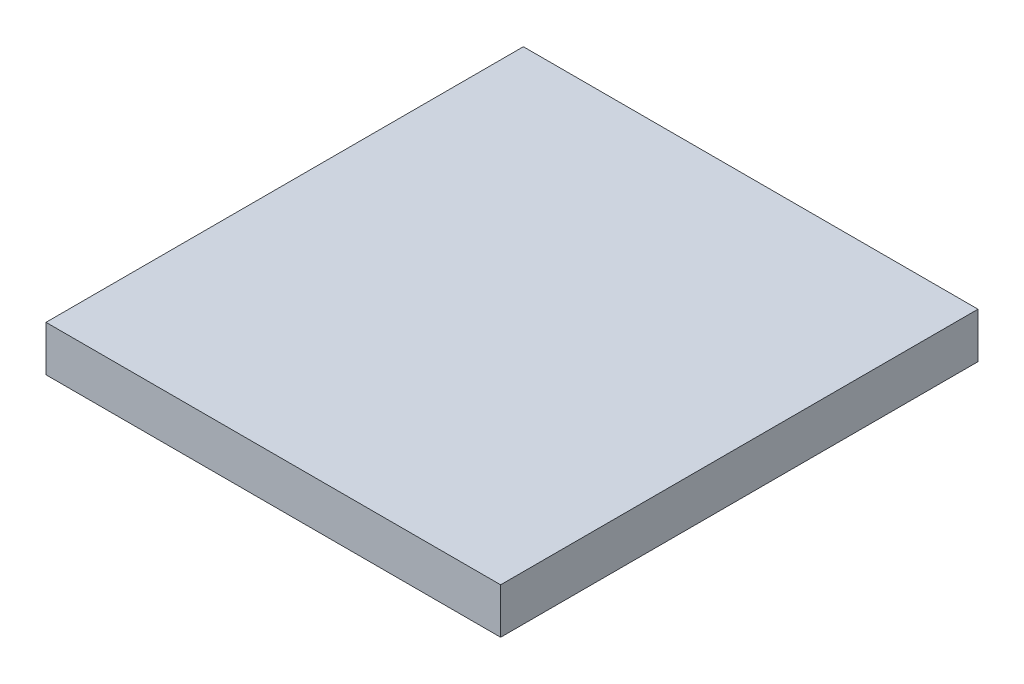
ISO-10303-21;
HEADER;
FILE_DESCRIPTION(('STEP AP214'),'2;1');
FILE_NAME('part.step','',(''),(''),'','','');
FILE_SCHEMA(('AUTOMOTIVE_DESIGN { 1 0 10303 214 1 1 1 1 }'));
ENDSEC;
DATA;
#1=APPLICATION_CONTEXT('core data for automotive mechanical design processes');
#2=APPLICATION_PROTOCOL_DEFINITION('international standard','automotive_design',2000,#1);
#3=PRODUCT_CONTEXT('',#1,'mechanical');
#4=PRODUCT('Part','Part','',(#3));
#5=PRODUCT_RELATED_PRODUCT_CATEGORY('part','',(#4));
#6=PRODUCT_DEFINITION_FORMATION('','',#4);
#7=PRODUCT_DEFINITION_CONTEXT('part definition',#1,'design');
#8=PRODUCT_DEFINITION('design','',#6,#7);
#9=PRODUCT_DEFINITION_SHAPE('','',#8);
#10=(LENGTH_UNIT() NAMED_UNIT(*) SI_UNIT(.MILLI.,.METRE.));
#11=(NAMED_UNIT(*) PLANE_ANGLE_UNIT() SI_UNIT($,.RADIAN.));
#12=(NAMED_UNIT(*) SI_UNIT($,.STERADIAN.) SOLID_ANGLE_UNIT());
#13=UNCERTAINTY_MEASURE_WITH_UNIT(LENGTH_MEASURE(1.E-05),#10,'distance_accuracy_value','');
#14=(GEOMETRIC_REPRESENTATION_CONTEXT(3) GLOBAL_UNCERTAINTY_ASSIGNED_CONTEXT((#13)) GLOBAL_UNIT_ASSIGNED_CONTEXT((#10,
#11,#12)) REPRESENTATION_CONTEXT('',''));
#15=CARTESIAN_POINT('',(0.,0.,0.));
#16=DIRECTION('',(0.,0.,1.));
#17=DIRECTION('',(1.,0.,0.));
#18=AXIS2_PLACEMENT_3D('',#15,#16,#17);
#19=CARTESIAN_POINT('',(6.0000007,0.60000134,0.));
#20=DIRECTION('',(0.,-1.,0.));
#21=DIRECTION('',(0.,0.,-1.));
#22=AXIS2_PLACEMENT_3D('',#19,#20,#21);
#23=PLANE('',#22);
#24=DIRECTION('',(0.,0.,-1.));
#25=VECTOR('',#24,1.);
#26=CARTESIAN_POINT('',(-6.0000007,0.60000134,0.));
#27=LINE('',#26,#25);
#28=CARTESIAN_POINT('',(-6.0000007,0.60000134,0.));
#29=VERTEX_POINT('',#28);
#30=CARTESIAN_POINT('',(-6.0000007,0.60000134,12.6000002));
#31=VERTEX_POINT('',#30);
#32=EDGE_CURVE('E20',#29,#31,#27,.F.);
#33=ORIENTED_EDGE('',*,*,#32,.T.);
#34=DIRECTION('',(-1.,0.,0.));
#35=VECTOR('',#34,1.);
#36=CARTESIAN_POINT('',(-6.0000007,0.60000134,12.6000002));
#37=LINE('',#36,#35);
#38=CARTESIAN_POINT('',(6.0000007,0.60000134,12.6000002));
#39=VERTEX_POINT('',#38);
#40=EDGE_CURVE('E55',#31,#39,#37,.F.);
#41=ORIENTED_EDGE('',*,*,#40,.T.);
#42=DIRECTION('',(0.,0.,1.));
#43=VECTOR('',#42,1.);
#44=CARTESIAN_POINT('',(6.0000007,0.60000134,0.));
#45=LINE('',#44,#43);
#46=CARTESIAN_POINT('',(6.0000007,0.60000134,0.));
#47=VERTEX_POINT('',#46);
#48=EDGE_CURVE('E74',#39,#47,#45,.F.);
#49=ORIENTED_EDGE('',*,*,#48,.T.);
#50=DIRECTION('',(-1.,0.,0.));
#51=VECTOR('',#50,1.);
#52=CARTESIAN_POINT('',(-6.0000007,0.60000134,0.));
#53=LINE('',#52,#51);
#54=EDGE_CURVE('E66',#29,#47,#53,.F.);
#55=ORIENTED_EDGE('',*,*,#54,.F.);
#56=EDGE_LOOP('',(#33,#41,#49,#55));
#57=FACE_BOUND('',#56,.T.);
#58=ADVANCED_FACE('F17',(#57),#23,.F.);
#59=CARTESIAN_POINT('',(-6.0000007,0.60000134,0.));
#60=DIRECTION('',(1.,0.,0.));
#61=DIRECTION('',(0.,0.,-1.));
#62=AXIS2_PLACEMENT_3D('',#59,#60,#61);
#63=PLANE('',#62);
#64=DIRECTION('',(0.,0.,1.));
#65=VECTOR('',#64,1.);
#66=CARTESIAN_POINT('',(-6.0000007,-0.5999988,0.));
#67=LINE('',#66,#65);
#68=CARTESIAN_POINT('',(-6.0000007,-0.5999988,0.));
#69=VERTEX_POINT('',#68);
#70=CARTESIAN_POINT('',(-6.0000007,-0.5999988,12.6000002));
#71=VERTEX_POINT('',#70);
#72=EDGE_CURVE('E72',#69,#71,#67,.T.);
#73=ORIENTED_EDGE('',*,*,#72,.T.);
#74=DIRECTION('',(0.,1.,0.));
#75=VECTOR('',#74,1.);
#76=CARTESIAN_POINT('',(-6.0000007,0.60000134,12.6000002));
#77=LINE('',#76,#75);
#78=EDGE_CURVE('E62',#71,#31,#77,.T.);
#79=ORIENTED_EDGE('',*,*,#78,.T.);
#80=ORIENTED_EDGE('',*,*,#32,.F.);
#81=DIRECTION('',(0.,1.,0.));
#82=VECTOR('',#81,1.);
#83=CARTESIAN_POINT('',(-6.0000007,0.60000134,0.));
#84=LINE('',#83,#82);
#85=EDGE_CURVE('E80',#69,#29,#84,.T.);
#86=ORIENTED_EDGE('',*,*,#85,.F.);
#87=EDGE_LOOP('',(#73,#79,#80,#86));
#88=FACE_BOUND('',#87,.T.);
#89=ADVANCED_FACE('F71',(#88),#63,.F.);
#90=CARTESIAN_POINT('',(-6.0000007,0.60000134,12.6000002));
#91=DIRECTION('',(0.,0.,-1.));
#92=DIRECTION('',(-1.,0.,0.));
#93=AXIS2_PLACEMENT_3D('',#90,#91,#92);
#94=PLANE('',#93);
#95=DIRECTION('',(1.,0.,0.));
#96=VECTOR('',#95,1.);
#97=CARTESIAN_POINT('',(-6.0000007,-0.5999988,12.6000002));
#98=LINE('',#97,#96);
#99=CARTESIAN_POINT('',(6.0000007,-0.5999988,12.6000002));
#100=VERTEX_POINT('',#99);
#101=EDGE_CURVE('E83',#71,#100,#98,.T.);
#102=ORIENTED_EDGE('',*,*,#101,.T.);
#103=DIRECTION('',(0.,1.,0.));
#104=VECTOR('',#103,1.);
#105=CARTESIAN_POINT('',(6.0000007,-0.5999988,12.6000002));
#106=LINE('',#105,#104);
#107=EDGE_CURVE('E64',#100,#39,#106,.T.);
#108=ORIENTED_EDGE('',*,*,#107,.T.);
#109=ORIENTED_EDGE('',*,*,#40,.F.);
#110=ORIENTED_EDGE('',*,*,#78,.F.);
#111=EDGE_LOOP('',(#102,#108,#109,#110));
#112=FACE_BOUND('',#111,.T.);
#113=ADVANCED_FACE('F60',(#112),#94,.F.);
#114=CARTESIAN_POINT('',(6.0000007,-0.5999988,0.));
#115=DIRECTION('',(-1.,0.,0.));
#116=DIRECTION('',(0.,0.,1.));
#117=AXIS2_PLACEMENT_3D('',#114,#115,#116);
#118=PLANE('',#117);
#119=ORIENTED_EDGE('',*,*,#48,.F.);
#120=ORIENTED_EDGE('',*,*,#107,.F.);
#121=DIRECTION('',(0.,0.,1.));
#122=VECTOR('',#121,1.);
#123=CARTESIAN_POINT('',(6.0000007,-0.5999988,0.));
#124=LINE('',#123,#122);
#125=CARTESIAN_POINT('',(6.0000007,-0.5999988,0.));
#126=VERTEX_POINT('',#125);
#127=EDGE_CURVE('E26',#100,#126,#124,.F.);
#128=ORIENTED_EDGE('',*,*,#127,.T.);
#129=DIRECTION('',(0.,1.,0.));
#130=VECTOR('',#129,1.);
#131=CARTESIAN_POINT('',(6.0000007,0.60000134,0.));
#132=LINE('',#131,#130);
#133=EDGE_CURVE('E34',#47,#126,#132,.F.);
#134=ORIENTED_EDGE('',*,*,#133,.F.);
#135=EDGE_LOOP('',(#119,#120,#128,#134));
#136=FACE_BOUND('',#135,.T.);
#137=ADVANCED_FACE('F88',(#136),#118,.F.);
#138=CARTESIAN_POINT('',(-6.0000007,0.60000134,0.));
#139=DIRECTION('',(0.,0.,-1.));
#140=DIRECTION('',(-1.,0.,0.));
#141=AXIS2_PLACEMENT_3D('',#138,#139,#140);
#142=PLANE('',#141);
#143=DIRECTION('',(1.,0.,0.));
#144=VECTOR('',#143,1.);
#145=CARTESIAN_POINT('',(-6.0000007,-0.5999988,0.));
#146=LINE('',#145,#144);
#147=EDGE_CURVE('E11',#126,#69,#146,.F.);
#148=ORIENTED_EDGE('',*,*,#147,.T.);
#149=ORIENTED_EDGE('',*,*,#85,.T.);
#150=ORIENTED_EDGE('',*,*,#54,.T.);
#151=ORIENTED_EDGE('',*,*,#133,.T.);
#152=EDGE_LOOP('',(#148,#149,#150,#151));
#153=FACE_BOUND('',#152,.T.);
#154=ADVANCED_FACE('F91',(#153),#142,.T.);
#155=CARTESIAN_POINT('',(-6.0000007,-0.5999988,0.));
#156=DIRECTION('',(0.,1.,0.));
#157=DIRECTION('',(0.,0.,1.));
#158=AXIS2_PLACEMENT_3D('',#155,#156,#157);
#159=PLANE('',#158);
#160=ORIENTED_EDGE('',*,*,#127,.F.);
#161=ORIENTED_EDGE('',*,*,#101,.F.);
#162=ORIENTED_EDGE('',*,*,#72,.F.);
#163=ORIENTED_EDGE('',*,*,#147,.F.);
#164=EDGE_LOOP('',(#160,#161,#162,#163));
#165=FACE_BOUND('',#164,.T.);
#166=ADVANCED_FACE('F90',(#165),#159,.F.);
#167=CLOSED_SHELL('',(#58,#89,#113,#137,#154,#166));
#168=MANIFOLD_SOLID_BREP('B1',#167);
#169=ADVANCED_BREP_SHAPE_REPRESENTATION('',(#18,#168),#14);
#170=SHAPE_DEFINITION_REPRESENTATION(#9,#169);
ENDSEC;
END-ISO-10303-21;
